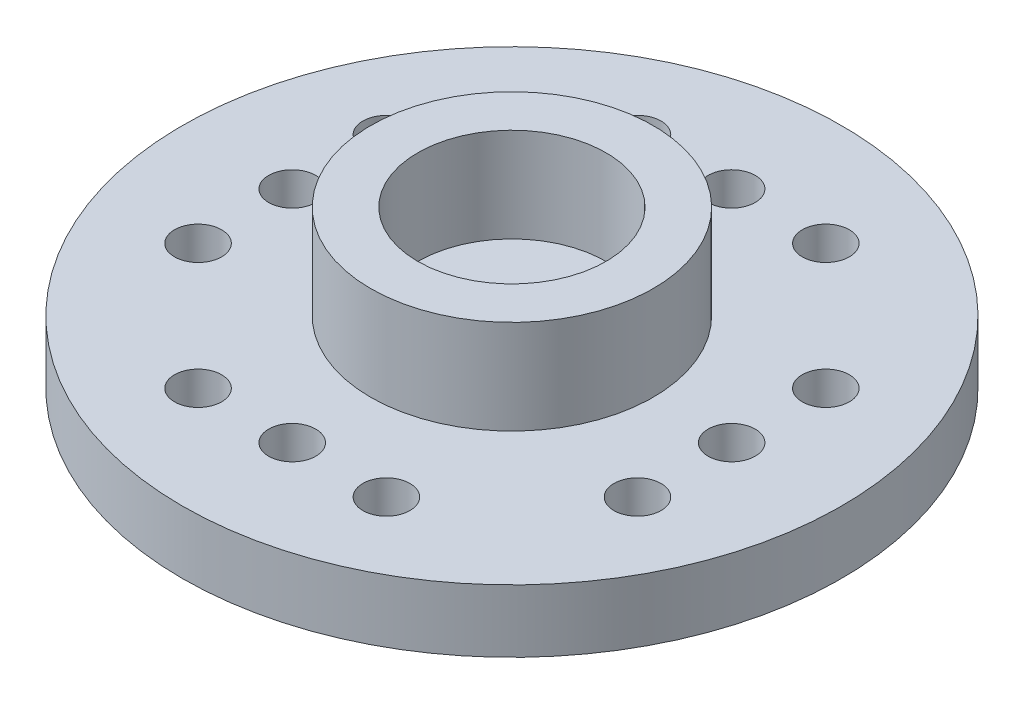
ISO-10303-21;
HEADER;
FILE_DESCRIPTION(('STEP AP214'),'2;1');
FILE_NAME('part.step','',(''),(''),'','','');
FILE_SCHEMA(('AUTOMOTIVE_DESIGN { 1 0 10303 214 1 1 1 1 }'));
ENDSEC;
DATA;
#1=APPLICATION_CONTEXT('core data for automotive mechanical design processes');
#2=APPLICATION_PROTOCOL_DEFINITION('international standard','automotive_design',2000,#1);
#3=PRODUCT_CONTEXT('',#1,'mechanical');
#4=PRODUCT('Part','Part','',(#3));
#5=PRODUCT_RELATED_PRODUCT_CATEGORY('part','',(#4));
#6=PRODUCT_DEFINITION_FORMATION('','',#4);
#7=PRODUCT_DEFINITION_CONTEXT('part definition',#1,'design');
#8=PRODUCT_DEFINITION('design','',#6,#7);
#9=PRODUCT_DEFINITION_SHAPE('','',#8);
#10=(LENGTH_UNIT() NAMED_UNIT(*) SI_UNIT(.MILLI.,.METRE.));
#11=(NAMED_UNIT(*) PLANE_ANGLE_UNIT() SI_UNIT($,.RADIAN.));
#12=(NAMED_UNIT(*) SI_UNIT($,.STERADIAN.) SOLID_ANGLE_UNIT());
#13=UNCERTAINTY_MEASURE_WITH_UNIT(LENGTH_MEASURE(1.E-05),#10,'distance_accuracy_value','');
#14=(GEOMETRIC_REPRESENTATION_CONTEXT(3) GLOBAL_UNCERTAINTY_ASSIGNED_CONTEXT((#13)) GLOBAL_UNIT_ASSIGNED_CONTEXT((#10,
#11,#12)) REPRESENTATION_CONTEXT('',''));
#15=CARTESIAN_POINT('',(0.,0.,0.));
#16=DIRECTION('',(0.,0.,1.));
#17=DIRECTION('',(1.,0.,0.));
#18=AXIS2_PLACEMENT_3D('',#15,#16,#17);
#19=CARTESIAN_POINT('',(0.,-1.,0.));
#20=DIRECTION('',(0.,1.,0.));
#21=DIRECTION('',(0.,0.,1.));
#22=AXIS2_PLACEMENT_3D('',#19,#20,#21);
#23=CYLINDRICAL_SURFACE('',#22,1.);
#24=CARTESIAN_POINT('',(0.,2.,0.));
#25=DIRECTION('',(0.,1.,0.));
#26=DIRECTION('',(0.,0.,1.));
#27=AXIS2_PLACEMENT_3D('',#24,#25,#26);
#28=CIRCLE('',#27,1.);
#29=CARTESIAN_POINT('',(0.,2.,1.));
#30=VERTEX_POINT('',#29);
#31=EDGE_CURVE('E62',#30,#30,#28,.T.);
#32=ORIENTED_EDGE('',*,*,#31,.T.);
#33=EDGE_LOOP('',(#32));
#34=FACE_BOUND('',#33,.T.);
#35=CARTESIAN_POINT('',(0.,0.5,0.));
#36=DIRECTION('',(0.,-1.,0.));
#37=DIRECTION('',(0.,0.,-1.));
#38=AXIS2_PLACEMENT_3D('',#35,#36,#37);
#39=CIRCLE('',#38,1.);
#40=CARTESIAN_POINT('',(0.,0.5,-1.));
#41=VERTEX_POINT('',#40);
#42=EDGE_CURVE('E81',#41,#41,#39,.F.);
#43=ORIENTED_EDGE('',*,*,#42,.F.);
#44=EDGE_LOOP('',(#43));
#45=FACE_BOUND('',#44,.T.);
#46=ADVANCED_FACE('F36',(#34,#45),#23,.F.);
#47=CARTESIAN_POINT('',(0.,0.,0.));
#48=DIRECTION('',(0.,1.,0.));
#49=DIRECTION('',(0.,0.,1.));
#50=AXIS2_PLACEMENT_3D('',#47,#48,#49);
#51=PLANE('',#50);
#52=CARTESIAN_POINT('',(0.,0.,0.));
#53=DIRECTION('',(0.,-1.,0.));
#54=DIRECTION('',(0.,0.,-1.));
#55=AXIS2_PLACEMENT_3D('',#52,#53,#54);
#56=CIRCLE('',#55,2.75);
#57=CARTESIAN_POINT('',(0.,0.,-2.75));
#58=VERTEX_POINT('',#57);
#59=EDGE_CURVE('E78',#58,#58,#56,.T.);
#60=ORIENTED_EDGE('',*,*,#59,.F.);
#61=EDGE_LOOP('',(#60));
#62=FACE_BOUND('',#61,.T.);
#63=CARTESIAN_POINT('',(0.,0.,0.));
#64=DIRECTION('',(0.,-1.,0.));
#65=DIRECTION('',(0.,0.,-1.));
#66=AXIS2_PLACEMENT_3D('',#63,#64,#65);
#67=CIRCLE('',#66,3.25);
#68=CARTESIAN_POINT('',(0.,0.,-3.25));
#69=VERTEX_POINT('',#68);
#70=EDGE_CURVE('E70',#69,#69,#67,.T.);
#71=ORIENTED_EDGE('',*,*,#70,.T.);
#72=EDGE_LOOP('',(#71));
#73=FACE_BOUND('',#72,.T.);
#74=ADVANCED_FACE('F175',(#62,#73),#51,.F.);
#75=CARTESIAN_POINT('',(0.,2.,0.));
#76=DIRECTION('',(0.,-1.,0.));
#77=DIRECTION('',(0.,0.,-1.));
#78=AXIS2_PLACEMENT_3D('',#75,#76,#77);
#79=CYLINDRICAL_SURFACE('',#78,10.5);
#80=CARTESIAN_POINT('',(0.,2.,0.));
#81=DIRECTION('',(0.,1.,0.));
#82=DIRECTION('',(0.,0.,1.));
#83=AXIS2_PLACEMENT_3D('',#80,#81,#82);
#84=CIRCLE('',#83,10.5);
#85=CARTESIAN_POINT('',(0.,2.,10.5));
#86=VERTEX_POINT('',#85);
#87=EDGE_CURVE('E43',#86,#86,#84,.T.);
#88=ORIENTED_EDGE('',*,*,#87,.F.);
#89=EDGE_LOOP('',(#88));
#90=FACE_BOUND('',#89,.T.);
#91=CARTESIAN_POINT('',(0.,0.,0.));
#92=DIRECTION('',(0.,1.,0.));
#93=DIRECTION('',(0.,0.,1.));
#94=AXIS2_PLACEMENT_3D('',#91,#92,#93);
#95=CIRCLE('',#94,10.5);
#96=CARTESIAN_POINT('',(0.,0.,10.5));
#97=VERTEX_POINT('',#96);
#98=EDGE_CURVE('E47',#97,#97,#95,.T.);
#99=ORIENTED_EDGE('',*,*,#98,.T.);
#100=EDGE_LOOP('',(#99));
#101=FACE_BOUND('',#100,.T.);
#102=ADVANCED_FACE('F38',(#90,#101),#79,.T.);
#103=CARTESIAN_POINT('',(0.,2.,0.));
#104=DIRECTION('',(0.,1.,0.));
#105=DIRECTION('',(0.,0.,1.));
#106=AXIS2_PLACEMENT_3D('',#103,#104,#105);
#107=PLANE('',#106);
#108=CARTESIAN_POINT('',(-7.,2.,3.));
#109=DIRECTION('',(0.,1.,0.));
#110=DIRECTION('',(0.,0.,1.));
#111=AXIS2_PLACEMENT_3D('',#108,#109,#110);
#112=CIRCLE('',#111,0.75);
#113=CARTESIAN_POINT('',(-7.,2.,3.75));
#114=VERTEX_POINT('',#113);
#115=EDGE_CURVE('E146',#114,#114,#112,.F.);
#116=ORIENTED_EDGE('',*,*,#115,.T.);
#117=EDGE_LOOP('',(#116));
#118=FACE_BOUND('',#117,.T.);
#119=CARTESIAN_POINT('',(-7.,2.,-3.));
#120=DIRECTION('',(0.,1.,0.));
#121=DIRECTION('',(0.,0.,1.));
#122=AXIS2_PLACEMENT_3D('',#119,#120,#121);
#123=CIRCLE('',#122,0.749999999999999);
#124=CARTESIAN_POINT('',(-7.,2.,-2.25));
#125=VERTEX_POINT('',#124);
#126=EDGE_CURVE('E149',#125,#125,#123,.F.);
#127=ORIENTED_EDGE('',*,*,#126,.T.);
#128=EDGE_LOOP('',(#127));
#129=FACE_BOUND('',#128,.T.);
#130=CARTESIAN_POINT('',(-7.,2.,0.));
#131=DIRECTION('',(0.,1.,0.));
#132=DIRECTION('',(0.,0.,1.));
#133=AXIS2_PLACEMENT_3D('',#130,#131,#132);
#134=CIRCLE('',#133,0.749999999999999);
#135=CARTESIAN_POINT('',(-7.,2.,0.749999999999999));
#136=VERTEX_POINT('',#135);
#137=EDGE_CURVE('E138',#136,#136,#134,.F.);
#138=ORIENTED_EDGE('',*,*,#137,.T.);
#139=EDGE_LOOP('',(#138));
#140=FACE_BOUND('',#139,.T.);
#141=CARTESIAN_POINT('',(7.,2.,3.));
#142=DIRECTION('',(0.,1.,0.));
#143=DIRECTION('',(0.,0.,1.));
#144=AXIS2_PLACEMENT_3D('',#141,#142,#143);
#145=CIRCLE('',#144,0.75);
#146=CARTESIAN_POINT('',(7.,2.,3.75));
#147=VERTEX_POINT('',#146);
#148=EDGE_CURVE('E128',#147,#147,#145,.T.);
#149=ORIENTED_EDGE('',*,*,#148,.F.);
#150=EDGE_LOOP('',(#149));
#151=FACE_BOUND('',#150,.T.);
#152=CARTESIAN_POINT('',(7.,2.,-3.));
#153=DIRECTION('',(0.,1.,0.));
#154=DIRECTION('',(0.,0.,1.));
#155=AXIS2_PLACEMENT_3D('',#152,#153,#154);
#156=CIRCLE('',#155,0.749999999999999);
#157=CARTESIAN_POINT('',(7.,2.,-2.25));
#158=VERTEX_POINT('',#157);
#159=EDGE_CURVE('E131',#158,#158,#156,.T.);
#160=ORIENTED_EDGE('',*,*,#159,.F.);
#161=EDGE_LOOP('',(#160));
#162=FACE_BOUND('',#161,.T.);
#163=CARTESIAN_POINT('',(7.,2.,0.));
#164=DIRECTION('',(0.,1.,0.));
#165=DIRECTION('',(0.,0.,1.));
#166=AXIS2_PLACEMENT_3D('',#163,#164,#165);
#167=CIRCLE('',#166,0.749999999999999);
#168=CARTESIAN_POINT('',(7.,2.,0.749999999999999));
#169=VERTEX_POINT('',#168);
#170=EDGE_CURVE('E120',#169,#169,#167,.T.);
#171=ORIENTED_EDGE('',*,*,#170,.F.);
#172=EDGE_LOOP('',(#171));
#173=FACE_BOUND('',#172,.T.);
#174=CARTESIAN_POINT('',(3.,2.,-7.));
#175=DIRECTION('',(0.,1.,0.));
#176=DIRECTION('',(0.,0.,1.));
#177=AXIS2_PLACEMENT_3D('',#174,#175,#176);
#178=CIRCLE('',#177,0.75);
#179=CARTESIAN_POINT('',(3.,2.,-6.25));
#180=VERTEX_POINT('',#179);
#181=EDGE_CURVE('E110',#180,#180,#178,.F.);
#182=ORIENTED_EDGE('',*,*,#181,.T.);
#183=EDGE_LOOP('',(#182));
#184=FACE_BOUND('',#183,.T.);
#185=CARTESIAN_POINT('',(-3.,2.,-7.));
#186=DIRECTION('',(0.,1.,0.));
#187=DIRECTION('',(0.,0.,1.));
#188=AXIS2_PLACEMENT_3D('',#185,#186,#187);
#189=CIRCLE('',#188,0.75);
#190=CARTESIAN_POINT('',(-3.,2.,-6.25));
#191=VERTEX_POINT('',#190);
#192=EDGE_CURVE('E113',#191,#191,#189,.F.);
#193=ORIENTED_EDGE('',*,*,#192,.T.);
#194=EDGE_LOOP('',(#193));
#195=FACE_BOUND('',#194,.T.);
#196=CARTESIAN_POINT('',(0.,2.,-7.));
#197=DIRECTION('',(0.,1.,0.));
#198=DIRECTION('',(0.,0.,1.));
#199=AXIS2_PLACEMENT_3D('',#196,#197,#198);
#200=CIRCLE('',#199,0.75);
#201=CARTESIAN_POINT('',(0.,2.,-6.25));
#202=VERTEX_POINT('',#201);
#203=EDGE_CURVE('E102',#202,#202,#200,.F.);
#204=ORIENTED_EDGE('',*,*,#203,.T.);
#205=EDGE_LOOP('',(#204));
#206=FACE_BOUND('',#205,.T.);
#207=CARTESIAN_POINT('',(3.,2.,7.));
#208=DIRECTION('',(0.,1.,0.));
#209=DIRECTION('',(0.,0.,1.));
#210=AXIS2_PLACEMENT_3D('',#207,#208,#209);
#211=CIRCLE('',#210,0.75);
#212=CARTESIAN_POINT('',(3.,2.,7.75));
#213=VERTEX_POINT('',#212);
#214=EDGE_CURVE('E92',#213,#213,#211,.T.);
#215=ORIENTED_EDGE('',*,*,#214,.F.);
#216=EDGE_LOOP('',(#215));
#217=FACE_BOUND('',#216,.T.);
#218=CARTESIAN_POINT('',(-3.,2.,7.));
#219=DIRECTION('',(0.,1.,0.));
#220=DIRECTION('',(0.,0.,1.));
#221=AXIS2_PLACEMENT_3D('',#218,#219,#220);
#222=CIRCLE('',#221,0.75);
#223=CARTESIAN_POINT('',(-3.,2.,7.75));
#224=VERTEX_POINT('',#223);
#225=EDGE_CURVE('E95',#224,#224,#222,.T.);
#226=ORIENTED_EDGE('',*,*,#225,.F.);
#227=EDGE_LOOP('',(#226));
#228=FACE_BOUND('',#227,.T.);
#229=CARTESIAN_POINT('',(0.,2.,7.));
#230=DIRECTION('',(0.,1.,0.));
#231=DIRECTION('',(0.,0.,1.));
#232=AXIS2_PLACEMENT_3D('',#229,#230,#231);
#233=CIRCLE('',#232,0.75);
#234=CARTESIAN_POINT('',(0.,2.,7.75));
#235=VERTEX_POINT('',#234);
#236=EDGE_CURVE('E82',#235,#235,#233,.T.);
#237=ORIENTED_EDGE('',*,*,#236,.F.);
#238=EDGE_LOOP('',(#237));
#239=FACE_BOUND('',#238,.T.);
#240=CARTESIAN_POINT('',(0.,2.,0.));
#241=DIRECTION('',(0.,1.,0.));
#242=DIRECTION('',(0.,0.,1.));
#243=AXIS2_PLACEMENT_3D('',#240,#241,#242);
#244=CIRCLE('',#243,4.5);
#245=CARTESIAN_POINT('',(0.,2.,4.5));
#246=VERTEX_POINT('',#245);
#247=EDGE_CURVE('E54',#246,#246,#244,.T.);
#248=ORIENTED_EDGE('',*,*,#247,.F.);
#249=EDGE_LOOP('',(#248));
#250=FACE_BOUND('',#249,.T.);
#251=ORIENTED_EDGE('',*,*,#87,.T.);
#252=EDGE_LOOP('',(#251));
#253=FACE_BOUND('',#252,.T.);
#254=ADVANCED_FACE('F200',(#118,#129,#140,#151,#162,#173,#184,#195,#206,#217,#228,#239,#250,
#253),#107,.T.);
#255=CARTESIAN_POINT('',(-7.,0.,3.));
#256=DIRECTION('',(0.,1.,0.));
#257=DIRECTION('',(0.,0.,-1.));
#258=AXIS2_PLACEMENT_3D('',#255,#256,#257);
#259=CIRCLE('',#258,0.75);
#260=CARTESIAN_POINT('',(-7.,0.,2.25));
#261=VERTEX_POINT('',#260);
#262=EDGE_CURVE('E152',#261,#261,#259,.T.);
#263=ORIENTED_EDGE('',*,*,#262,.T.);
#264=EDGE_LOOP('',(#263));
#265=FACE_BOUND('',#264,.T.);
#266=CARTESIAN_POINT('',(-7.,0.,-3.));
#267=DIRECTION('',(0.,1.,0.));
#268=DIRECTION('',(0.,0.,-1.));
#269=AXIS2_PLACEMENT_3D('',#266,#267,#268);
#270=CIRCLE('',#269,0.749999999999999);
#271=CARTESIAN_POINT('',(-7.,0.,-3.75));
#272=VERTEX_POINT('',#271);
#273=EDGE_CURVE('E153',#272,#272,#270,.T.);
#274=ORIENTED_EDGE('',*,*,#273,.T.);
#275=EDGE_LOOP('',(#274));
#276=FACE_BOUND('',#275,.T.);
#277=CARTESIAN_POINT('',(-7.,0.,0.));
#278=DIRECTION('',(0.,1.,0.));
#279=DIRECTION('',(0.,0.,-1.));
#280=AXIS2_PLACEMENT_3D('',#277,#278,#279);
#281=CIRCLE('',#280,0.749999999999999);
#282=CARTESIAN_POINT('',(-7.,0.,-0.749999999999999));
#283=VERTEX_POINT('',#282);
#284=EDGE_CURVE('E143',#283,#283,#281,.T.);
#285=ORIENTED_EDGE('',*,*,#284,.T.);
#286=EDGE_LOOP('',(#285));
#287=FACE_BOUND('',#286,.T.);
#288=CARTESIAN_POINT('',(7.,0.,3.));
#289=DIRECTION('',(0.,-1.,0.));
#290=DIRECTION('',(0.,0.,-1.));
#291=AXIS2_PLACEMENT_3D('',#288,#289,#290);
#292=CIRCLE('',#291,0.75);
#293=CARTESIAN_POINT('',(7.,0.,2.25));
#294=VERTEX_POINT('',#293);
#295=EDGE_CURVE('E134',#294,#294,#292,.T.);
#296=ORIENTED_EDGE('',*,*,#295,.F.);
#297=EDGE_LOOP('',(#296));
#298=FACE_BOUND('',#297,.T.);
#299=CARTESIAN_POINT('',(7.,0.,-3.));
#300=DIRECTION('',(0.,-1.,0.));
#301=DIRECTION('',(0.,0.,-1.));
#302=AXIS2_PLACEMENT_3D('',#299,#300,#301);
#303=CIRCLE('',#302,0.749999999999999);
#304=CARTESIAN_POINT('',(7.,0.,-3.75));
#305=VERTEX_POINT('',#304);
#306=EDGE_CURVE('E135',#305,#305,#303,.T.);
#307=ORIENTED_EDGE('',*,*,#306,.F.);
#308=EDGE_LOOP('',(#307));
#309=FACE_BOUND('',#308,.T.);
#310=CARTESIAN_POINT('',(7.,0.,0.));
#311=DIRECTION('',(0.,-1.,0.));
#312=DIRECTION('',(0.,0.,-1.));
#313=AXIS2_PLACEMENT_3D('',#310,#311,#312);
#314=CIRCLE('',#313,0.749999999999999);
#315=CARTESIAN_POINT('',(7.,0.,-0.749999999999999));
#316=VERTEX_POINT('',#315);
#317=EDGE_CURVE('E125',#316,#316,#314,.T.);
#318=ORIENTED_EDGE('',*,*,#317,.F.);
#319=EDGE_LOOP('',(#318));
#320=FACE_BOUND('',#319,.T.);
#321=CARTESIAN_POINT('',(3.,0.,-7.));
#322=DIRECTION('',(0.,1.,0.));
#323=DIRECTION('',(0.,0.,1.));
#324=AXIS2_PLACEMENT_3D('',#321,#322,#323);
#325=CIRCLE('',#324,0.75);
#326=CARTESIAN_POINT('',(3.,0.,-6.25));
#327=VERTEX_POINT('',#326);
#328=EDGE_CURVE('E116',#327,#327,#325,.T.);
#329=ORIENTED_EDGE('',*,*,#328,.T.);
#330=EDGE_LOOP('',(#329));
#331=FACE_BOUND('',#330,.T.);
#332=CARTESIAN_POINT('',(-3.,0.,-7.));
#333=DIRECTION('',(0.,1.,0.));
#334=DIRECTION('',(0.,0.,1.));
#335=AXIS2_PLACEMENT_3D('',#332,#333,#334);
#336=CIRCLE('',#335,0.75);
#337=CARTESIAN_POINT('',(-3.,0.,-6.25));
#338=VERTEX_POINT('',#337);
#339=EDGE_CURVE('E117',#338,#338,#336,.T.);
#340=ORIENTED_EDGE('',*,*,#339,.T.);
#341=EDGE_LOOP('',(#340));
#342=FACE_BOUND('',#341,.T.);
#343=CARTESIAN_POINT('',(0.,0.,-7.));
#344=DIRECTION('',(0.,1.,0.));
#345=DIRECTION('',(0.,0.,1.));
#346=AXIS2_PLACEMENT_3D('',#343,#344,#345);
#347=CIRCLE('',#346,0.75);
#348=CARTESIAN_POINT('',(0.,0.,-6.25));
#349=VERTEX_POINT('',#348);
#350=EDGE_CURVE('E107',#349,#349,#347,.T.);
#351=ORIENTED_EDGE('',*,*,#350,.T.);
#352=EDGE_LOOP('',(#351));
#353=FACE_BOUND('',#352,.T.);
#354=CARTESIAN_POINT('',(3.,0.,7.));
#355=DIRECTION('',(0.,-1.,0.));
#356=DIRECTION('',(0.,0.,-1.));
#357=AXIS2_PLACEMENT_3D('',#354,#355,#356);
#358=CIRCLE('',#357,0.75);
#359=CARTESIAN_POINT('',(3.,0.,6.25));
#360=VERTEX_POINT('',#359);
#361=EDGE_CURVE('E98',#360,#360,#358,.T.);
#362=ORIENTED_EDGE('',*,*,#361,.F.);
#363=EDGE_LOOP('',(#362));
#364=FACE_BOUND('',#363,.T.);
#365=CARTESIAN_POINT('',(-3.,0.,7.));
#366=DIRECTION('',(0.,-1.,0.));
#367=DIRECTION('',(0.,0.,-1.));
#368=AXIS2_PLACEMENT_3D('',#365,#366,#367);
#369=CIRCLE('',#368,0.75);
#370=CARTESIAN_POINT('',(-3.,0.,6.25));
#371=VERTEX_POINT('',#370);
#372=EDGE_CURVE('E99',#371,#371,#369,.T.);
#373=ORIENTED_EDGE('',*,*,#372,.F.);
#374=EDGE_LOOP('',(#373));
#375=FACE_BOUND('',#374,.T.);
#376=CARTESIAN_POINT('',(0.,0.,7.));
#377=DIRECTION('',(0.,-1.,0.));
#378=DIRECTION('',(0.,0.,-1.));
#379=AXIS2_PLACEMENT_3D('',#376,#377,#378);
#380=CIRCLE('',#379,0.75);
#381=CARTESIAN_POINT('',(0.,0.,6.25));
#382=VERTEX_POINT('',#381);
#383=EDGE_CURVE('E89',#382,#382,#380,.T.);
#384=ORIENTED_EDGE('',*,*,#383,.F.);
#385=EDGE_LOOP('',(#384));
#386=FACE_BOUND('',#385,.T.);
#387=CARTESIAN_POINT('',(0.,0.,0.));
#388=DIRECTION('',(0.,-1.,0.));
#389=DIRECTION('',(0.,0.,-1.));
#390=AXIS2_PLACEMENT_3D('',#387,#388,#389);
#391=CIRCLE('',#390,4.25);
#392=CARTESIAN_POINT('',(0.,0.,-4.25));
#393=VERTEX_POINT('',#392);
#394=EDGE_CURVE('E66',#393,#393,#391,.T.);
#395=ORIENTED_EDGE('',*,*,#394,.F.);
#396=EDGE_LOOP('',(#395));
#397=FACE_BOUND('',#396,.T.);
#398=ORIENTED_EDGE('',*,*,#98,.F.);
#399=EDGE_LOOP('',(#398));
#400=FACE_BOUND('',#399,.T.);
#401=ADVANCED_FACE('F159',(#265,#276,#287,#298,#309,#320,#331,#342,#353,#364,#375,#386,#397,
#400),#51,.F.);
#402=CARTESIAN_POINT('',(0.,5.,0.));
#403=DIRECTION('',(0.,1.,0.));
#404=DIRECTION('',(0.,0.,1.));
#405=AXIS2_PLACEMENT_3D('',#402,#403,#404);
#406=PLANE('',#405);
#407=CARTESIAN_POINT('',(0.,5.,0.));
#408=DIRECTION('',(0.,1.,0.));
#409=DIRECTION('',(0.,0.,1.));
#410=AXIS2_PLACEMENT_3D('',#407,#408,#409);
#411=CIRCLE('',#410,4.5);
#412=CARTESIAN_POINT('',(0.,5.,4.5));
#413=VERTEX_POINT('',#412);
#414=EDGE_CURVE('E52',#413,#413,#411,.T.);
#415=ORIENTED_EDGE('',*,*,#414,.T.);
#416=EDGE_LOOP('',(#415));
#417=FACE_BOUND('',#416,.T.);
#418=CARTESIAN_POINT('',(0.,5.,0.));
#419=DIRECTION('',(0.,1.,0.));
#420=DIRECTION('',(0.,0.,1.));
#421=AXIS2_PLACEMENT_3D('',#418,#419,#420);
#422=CIRCLE('',#421,3.);
#423=CARTESIAN_POINT('',(0.,5.,3.));
#424=VERTEX_POINT('',#423);
#425=EDGE_CURVE('E57',#424,#424,#422,.T.);
#426=ORIENTED_EDGE('',*,*,#425,.F.);
#427=EDGE_LOOP('',(#426));
#428=FACE_BOUND('',#427,.T.);
#429=ADVANCED_FACE('F193',(#417,#428),#406,.T.);
#430=CARTESIAN_POINT('',(0.,5.,0.));
#431=DIRECTION('',(0.,-1.,0.));
#432=DIRECTION('',(0.,0.,-1.));
#433=AXIS2_PLACEMENT_3D('',#430,#431,#432);
#434=CYLINDRICAL_SURFACE('',#433,4.5);
#435=ORIENTED_EDGE('',*,*,#414,.F.);
#436=EDGE_LOOP('',(#435));
#437=FACE_BOUND('',#436,.T.);
#438=ORIENTED_EDGE('',*,*,#247,.T.);
#439=EDGE_LOOP('',(#438));
#440=FACE_BOUND('',#439,.T.);
#441=ADVANCED_FACE('F191',(#437,#440),#434,.T.);
#442=CARTESIAN_POINT('',(0.,5.,0.));
#443=DIRECTION('',(0.,-1.,0.));
#444=DIRECTION('',(0.,0.,-1.));
#445=AXIS2_PLACEMENT_3D('',#442,#443,#444);
#446=CYLINDRICAL_SURFACE('',#445,3.);
#447=ORIENTED_EDGE('',*,*,#425,.T.);
#448=EDGE_LOOP('',(#447));
#449=FACE_BOUND('',#448,.T.);
#450=CARTESIAN_POINT('',(0.,2.,0.));
#451=DIRECTION('',(0.,1.,0.));
#452=DIRECTION('',(0.,0.,1.));
#453=AXIS2_PLACEMENT_3D('',#450,#451,#452);
#454=CIRCLE('',#453,3.);
#455=CARTESIAN_POINT('',(0.,2.,3.));
#456=VERTEX_POINT('',#455);
#457=EDGE_CURVE('E11',#456,#456,#454,.F.);
#458=ORIENTED_EDGE('',*,*,#457,.T.);
#459=EDGE_LOOP('',(#458));
#460=FACE_BOUND('',#459,.T.);
#461=ADVANCED_FACE('F187',(#449,#460),#446,.F.);
#462=ORIENTED_EDGE('',*,*,#31,.F.);
#463=EDGE_LOOP('',(#462));
#464=FACE_BOUND('',#463,.T.);
#465=ORIENTED_EDGE('',*,*,#457,.F.);
#466=EDGE_LOOP('',(#465));
#467=FACE_BOUND('',#466,.T.);
#468=ADVANCED_FACE('F190',(#464,#467),#107,.T.);
#469=CARTESIAN_POINT('',(0.,0.5,0.));
#470=DIRECTION('',(0.,-1.,0.));
#471=DIRECTION('',(0.,0.,-1.));
#472=AXIS2_PLACEMENT_3D('',#469,#470,#471);
#473=CYLINDRICAL_SURFACE('',#472,3.25);
#474=CARTESIAN_POINT('',(0.,0.5,0.));
#475=DIRECTION('',(0.,-1.,0.));
#476=DIRECTION('',(0.,0.,-1.));
#477=AXIS2_PLACEMENT_3D('',#474,#475,#476);
#478=CIRCLE('',#477,3.25);
#479=CARTESIAN_POINT('',(0.,0.5,-3.25));
#480=VERTEX_POINT('',#479);
#481=EDGE_CURVE('E69',#480,#480,#478,.T.);
#482=ORIENTED_EDGE('',*,*,#481,.T.);
#483=EDGE_LOOP('',(#482));
#484=FACE_BOUND('',#483,.T.);
#485=ORIENTED_EDGE('',*,*,#70,.F.);
#486=EDGE_LOOP('',(#485));
#487=FACE_BOUND('',#486,.T.);
#488=ADVANCED_FACE('F185',(#484,#487),#473,.T.);
#489=CARTESIAN_POINT('',(0.,0.5,0.));
#490=DIRECTION('',(0.,-1.,0.));
#491=DIRECTION('',(0.,0.,-1.));
#492=AXIS2_PLACEMENT_3D('',#489,#490,#491);
#493=CYLINDRICAL_SURFACE('',#492,4.25);
#494=CARTESIAN_POINT('',(0.,0.5,0.));
#495=DIRECTION('',(0.,-1.,0.));
#496=DIRECTION('',(0.,0.,-1.));
#497=AXIS2_PLACEMENT_3D('',#494,#495,#496);
#498=CIRCLE('',#497,4.25);
#499=CARTESIAN_POINT('',(0.,0.5,-4.25));
#500=VERTEX_POINT('',#499);
#501=EDGE_CURVE('E65',#500,#500,#498,.T.);
#502=ORIENTED_EDGE('',*,*,#501,.F.);
#503=EDGE_LOOP('',(#502));
#504=FACE_BOUND('',#503,.T.);
#505=ORIENTED_EDGE('',*,*,#394,.T.);
#506=EDGE_LOOP('',(#505));
#507=FACE_BOUND('',#506,.T.);
#508=ADVANCED_FACE('F235',(#504,#507),#493,.F.);
#509=CARTESIAN_POINT('',(0.,0.5,0.));
#510=DIRECTION('',(0.,-1.,0.));
#511=DIRECTION('',(0.,0.,-1.));
#512=AXIS2_PLACEMENT_3D('',#509,#510,#511);
#513=PLANE('',#512);
#514=ORIENTED_EDGE('',*,*,#481,.F.);
#515=EDGE_LOOP('',(#514));
#516=FACE_BOUND('',#515,.T.);
#517=ORIENTED_EDGE('',*,*,#501,.T.);
#518=EDGE_LOOP('',(#517));
#519=FACE_BOUND('',#518,.T.);
#520=ADVANCED_FACE('F243',(#516,#519),#513,.T.);
#521=CARTESIAN_POINT('',(0.,0.5,0.));
#522=DIRECTION('',(0.,-1.,0.));
#523=DIRECTION('',(0.,0.,-1.));
#524=AXIS2_PLACEMENT_3D('',#521,#522,#523);
#525=CYLINDRICAL_SURFACE('',#524,2.75);
#526=CARTESIAN_POINT('',(0.,0.5,0.));
#527=DIRECTION('',(0.,-1.,0.));
#528=DIRECTION('',(0.,0.,-1.));
#529=AXIS2_PLACEMENT_3D('',#526,#527,#528);
#530=CIRCLE('',#529,2.75);
#531=CARTESIAN_POINT('',(0.,0.5,-2.75));
#532=VERTEX_POINT('',#531);
#533=EDGE_CURVE('E73',#532,#532,#530,.T.);
#534=ORIENTED_EDGE('',*,*,#533,.F.);
#535=EDGE_LOOP('',(#534));
#536=FACE_BOUND('',#535,.T.);
#537=ORIENTED_EDGE('',*,*,#59,.T.);
#538=EDGE_LOOP('',(#537));
#539=FACE_BOUND('',#538,.T.);
#540=ADVANCED_FACE('F250',(#536,#539),#525,.F.);
#541=CARTESIAN_POINT('',(0.,0.5,0.));
#542=DIRECTION('',(0.,-1.,0.));
#543=DIRECTION('',(0.,0.,-1.));
#544=AXIS2_PLACEMENT_3D('',#541,#542,#543);
#545=PLANE('',#544);
#546=ORIENTED_EDGE('',*,*,#42,.T.);
#547=EDGE_LOOP('',(#546));
#548=FACE_BOUND('',#547,.T.);
#549=ORIENTED_EDGE('',*,*,#533,.T.);
#550=EDGE_LOOP('',(#549));
#551=FACE_BOUND('',#550,.T.);
#552=ADVANCED_FACE('F258',(#548,#551),#545,.T.);
#553=CARTESIAN_POINT('',(0.,2.5,7.));
#554=DIRECTION('',(0.,-1.,0.));
#555=DIRECTION('',(0.,0.,-1.));
#556=AXIS2_PLACEMENT_3D('',#553,#554,#555);
#557=CYLINDRICAL_SURFACE('',#556,0.75);
#558=ORIENTED_EDGE('',*,*,#236,.T.);
#559=EDGE_LOOP('',(#558));
#560=FACE_BOUND('',#559,.T.);
#561=ORIENTED_EDGE('',*,*,#383,.T.);
#562=EDGE_LOOP('',(#561));
#563=FACE_BOUND('',#562,.T.);
#564=ADVANCED_FACE('F266',(#560,#563),#557,.F.);
#565=CARTESIAN_POINT('',(-3.,2.5,7.));
#566=DIRECTION('',(0.,-1.,0.));
#567=DIRECTION('',(0.,0.,-1.));
#568=AXIS2_PLACEMENT_3D('',#565,#566,#567);
#569=CYLINDRICAL_SURFACE('',#568,0.75);
#570=ORIENTED_EDGE('',*,*,#225,.T.);
#571=EDGE_LOOP('',(#570));
#572=FACE_BOUND('',#571,.T.);
#573=ORIENTED_EDGE('',*,*,#372,.T.);
#574=EDGE_LOOP('',(#573));
#575=FACE_BOUND('',#574,.T.);
#576=ADVANCED_FACE('F274',(#572,#575),#569,.F.);
#577=CARTESIAN_POINT('',(3.,2.5,7.));
#578=DIRECTION('',(0.,-1.,0.));
#579=DIRECTION('',(0.,0.,-1.));
#580=AXIS2_PLACEMENT_3D('',#577,#578,#579);
#581=CYLINDRICAL_SURFACE('',#580,0.75);
#582=ORIENTED_EDGE('',*,*,#214,.T.);
#583=EDGE_LOOP('',(#582));
#584=FACE_BOUND('',#583,.T.);
#585=ORIENTED_EDGE('',*,*,#361,.T.);
#586=EDGE_LOOP('',(#585));
#587=FACE_BOUND('',#586,.T.);
#588=ADVANCED_FACE('F282',(#584,#587),#581,.F.);
#589=CARTESIAN_POINT('',(0.,2.5,-7.));
#590=DIRECTION('',(0.,-1.,0.));
#591=DIRECTION('',(0.,0.,-1.));
#592=AXIS2_PLACEMENT_3D('',#589,#590,#591);
#593=CYLINDRICAL_SURFACE('',#592,0.75);
#594=ORIENTED_EDGE('',*,*,#203,.F.);
#595=EDGE_LOOP('',(#594));
#596=FACE_BOUND('',#595,.T.);
#597=ORIENTED_EDGE('',*,*,#350,.F.);
#598=EDGE_LOOP('',(#597));
#599=FACE_BOUND('',#598,.T.);
#600=ADVANCED_FACE('F290',(#596,#599),#593,.F.);
#601=CARTESIAN_POINT('',(-3.,2.5,-7.));
#602=DIRECTION('',(0.,-1.,0.));
#603=DIRECTION('',(0.,0.,-1.));
#604=AXIS2_PLACEMENT_3D('',#601,#602,#603);
#605=CYLINDRICAL_SURFACE('',#604,0.75);
#606=ORIENTED_EDGE('',*,*,#192,.F.);
#607=EDGE_LOOP('',(#606));
#608=FACE_BOUND('',#607,.T.);
#609=ORIENTED_EDGE('',*,*,#339,.F.);
#610=EDGE_LOOP('',(#609));
#611=FACE_BOUND('',#610,.T.);
#612=ADVANCED_FACE('F298',(#608,#611),#605,.F.);
#613=CARTESIAN_POINT('',(3.,2.5,-7.));
#614=DIRECTION('',(0.,-1.,0.));
#615=DIRECTION('',(0.,0.,-1.));
#616=AXIS2_PLACEMENT_3D('',#613,#614,#615);
#617=CYLINDRICAL_SURFACE('',#616,0.75);
#618=ORIENTED_EDGE('',*,*,#181,.F.);
#619=EDGE_LOOP('',(#618));
#620=FACE_BOUND('',#619,.T.);
#621=ORIENTED_EDGE('',*,*,#328,.F.);
#622=EDGE_LOOP('',(#621));
#623=FACE_BOUND('',#622,.T.);
#624=ADVANCED_FACE('F306',(#620,#623),#617,.F.);
#625=CARTESIAN_POINT('',(7.,2.5,0.));
#626=DIRECTION('',(0.,-1.,0.));
#627=DIRECTION('',(0.,0.,-1.));
#628=AXIS2_PLACEMENT_3D('',#625,#626,#627);
#629=CYLINDRICAL_SURFACE('',#628,0.749999999999999);
#630=ORIENTED_EDGE('',*,*,#170,.T.);
#631=EDGE_LOOP('',(#630));
#632=FACE_BOUND('',#631,.T.);
#633=ORIENTED_EDGE('',*,*,#317,.T.);
#634=EDGE_LOOP('',(#633));
#635=FACE_BOUND('',#634,.T.);
#636=ADVANCED_FACE('F314',(#632,#635),#629,.F.);
#637=CARTESIAN_POINT('',(7.,2.5,-3.));
#638=DIRECTION('',(0.,-1.,0.));
#639=DIRECTION('',(0.,0.,-1.));
#640=AXIS2_PLACEMENT_3D('',#637,#638,#639);
#641=CYLINDRICAL_SURFACE('',#640,0.749999999999999);
#642=ORIENTED_EDGE('',*,*,#159,.T.);
#643=EDGE_LOOP('',(#642));
#644=FACE_BOUND('',#643,.T.);
#645=ORIENTED_EDGE('',*,*,#306,.T.);
#646=EDGE_LOOP('',(#645));
#647=FACE_BOUND('',#646,.T.);
#648=ADVANCED_FACE('F322',(#644,#647),#641,.F.);
#649=CARTESIAN_POINT('',(7.,2.5,3.));
#650=DIRECTION('',(0.,-1.,0.));
#651=DIRECTION('',(0.,0.,-1.));
#652=AXIS2_PLACEMENT_3D('',#649,#650,#651);
#653=CYLINDRICAL_SURFACE('',#652,0.75);
#654=ORIENTED_EDGE('',*,*,#148,.T.);
#655=EDGE_LOOP('',(#654));
#656=FACE_BOUND('',#655,.T.);
#657=ORIENTED_EDGE('',*,*,#295,.T.);
#658=EDGE_LOOP('',(#657));
#659=FACE_BOUND('',#658,.T.);
#660=ADVANCED_FACE('F330',(#656,#659),#653,.F.);
#661=CARTESIAN_POINT('',(-7.,2.5,0.));
#662=DIRECTION('',(0.,-1.,0.));
#663=DIRECTION('',(0.,0.,-1.));
#664=AXIS2_PLACEMENT_3D('',#661,#662,#663);
#665=CYLINDRICAL_SURFACE('',#664,0.749999999999999);
#666=ORIENTED_EDGE('',*,*,#137,.F.);
#667=EDGE_LOOP('',(#666));
#668=FACE_BOUND('',#667,.T.);
#669=ORIENTED_EDGE('',*,*,#284,.F.);
#670=EDGE_LOOP('',(#669));
#671=FACE_BOUND('',#670,.T.);
#672=ADVANCED_FACE('F170',(#668,#671),#665,.F.);
#673=CARTESIAN_POINT('',(-7.,2.5,-3.));
#674=DIRECTION('',(0.,-1.,0.));
#675=DIRECTION('',(0.,0.,-1.));
#676=AXIS2_PLACEMENT_3D('',#673,#674,#675);
#677=CYLINDRICAL_SURFACE('',#676,0.749999999999999);
#678=ORIENTED_EDGE('',*,*,#126,.F.);
#679=EDGE_LOOP('',(#678));
#680=FACE_BOUND('',#679,.T.);
#681=ORIENTED_EDGE('',*,*,#273,.F.);
#682=EDGE_LOOP('',(#681));
#683=FACE_BOUND('',#682,.T.);
#684=ADVANCED_FACE('F164',(#680,#683),#677,.F.);
#685=CARTESIAN_POINT('',(-7.,2.5,3.));
#686=DIRECTION('',(0.,-1.,0.));
#687=DIRECTION('',(0.,0.,-1.));
#688=AXIS2_PLACEMENT_3D('',#685,#686,#687);
#689=CYLINDRICAL_SURFACE('',#688,0.75);
#690=ORIENTED_EDGE('',*,*,#115,.F.);
#691=EDGE_LOOP('',(#690));
#692=FACE_BOUND('',#691,.T.);
#693=ORIENTED_EDGE('',*,*,#262,.F.);
#694=EDGE_LOOP('',(#693));
#695=FACE_BOUND('',#694,.T.);
#696=ADVANCED_FACE('F162',(#692,#695),#689,.F.);
#697=CLOSED_SHELL('',(#46,#74,#102,#254,#401,#429,#441,#461,#468,#488,#508,#520,#540,#552,#564,
#576,#588,#600,#612,#624,#636,#648,#660,#672,#684,#696));
#698=MANIFOLD_SOLID_BREP('B2',#697);
#699=ADVANCED_BREP_SHAPE_REPRESENTATION('',(#18,#698),#14);
#700=SHAPE_DEFINITION_REPRESENTATION(#9,#699);
ENDSEC;
END-ISO-10303-21;
